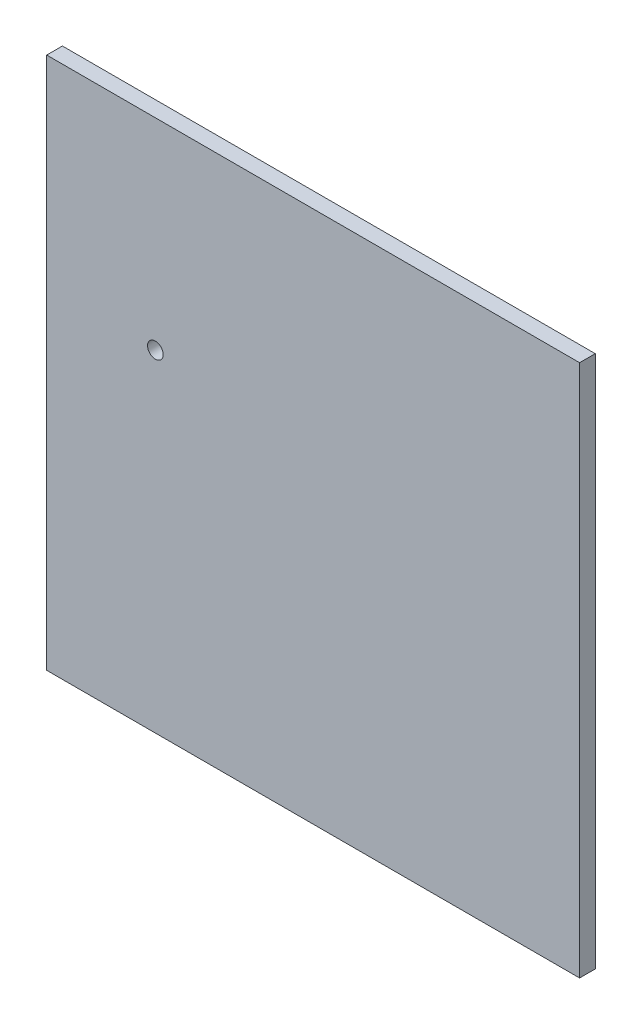
ISO-10303-21;
HEADER;
FILE_DESCRIPTION(('STEP AP214'),'2;1');
FILE_NAME('part.step','',(''),(''),'','','');
FILE_SCHEMA(('AUTOMOTIVE_DESIGN { 1 0 10303 214 1 1 1 1 }'));
ENDSEC;
DATA;
#1=APPLICATION_CONTEXT('core data for automotive mechanical design processes');
#2=APPLICATION_PROTOCOL_DEFINITION('international standard','automotive_design',2000,#1);
#3=PRODUCT_CONTEXT('',#1,'mechanical');
#4=PRODUCT('Part','Part','',(#3));
#5=PRODUCT_RELATED_PRODUCT_CATEGORY('part','',(#4));
#6=PRODUCT_DEFINITION_FORMATION('','',#4);
#7=PRODUCT_DEFINITION_CONTEXT('part definition',#1,'design');
#8=PRODUCT_DEFINITION('design','',#6,#7);
#9=PRODUCT_DEFINITION_SHAPE('','',#8);
#10=(LENGTH_UNIT() NAMED_UNIT(*) SI_UNIT(.MILLI.,.METRE.));
#11=(NAMED_UNIT(*) PLANE_ANGLE_UNIT() SI_UNIT($,.RADIAN.));
#12=(NAMED_UNIT(*) SI_UNIT($,.STERADIAN.) SOLID_ANGLE_UNIT());
#13=UNCERTAINTY_MEASURE_WITH_UNIT(LENGTH_MEASURE(1.E-05),#10,'distance_accuracy_value','');
#14=(GEOMETRIC_REPRESENTATION_CONTEXT(3) GLOBAL_UNCERTAINTY_ASSIGNED_CONTEXT((#13)) GLOBAL_UNIT_ASSIGNED_CONTEXT((#10,
#11,#12)) REPRESENTATION_CONTEXT('',''));
#15=CARTESIAN_POINT('',(0.,0.,0.));
#16=DIRECTION('',(0.,0.,1.));
#17=DIRECTION('',(1.,0.,0.));
#18=AXIS2_PLACEMENT_3D('',#15,#16,#17);
#19=CARTESIAN_POINT('',(17.,17.,1.));
#20=DIRECTION('',(0.,-1.,0.));
#21=DIRECTION('',(0.,0.,-1.));
#22=AXIS2_PLACEMENT_3D('',#19,#20,#21);
#23=PLANE('',#22);
#24=DIRECTION('',(-1.,0.,0.));
#25=VECTOR('',#24,1.);
#26=CARTESIAN_POINT('',(17.,17.,0.));
#27=LINE('',#26,#25);
#28=CARTESIAN_POINT('',(17.,17.,0.));
#29=VERTEX_POINT('',#28);
#30=CARTESIAN_POINT('',(-17.,17.,0.));
#31=VERTEX_POINT('',#30);
#32=EDGE_CURVE('E104',#29,#31,#27,.T.);
#33=ORIENTED_EDGE('',*,*,#32,.T.);
#34=DIRECTION('',(0.,0.,-1.));
#35=VECTOR('',#34,1.);
#36=CARTESIAN_POINT('',(-17.,17.,1.));
#37=LINE('',#36,#35);
#38=CARTESIAN_POINT('',(-17.,17.,1.));
#39=VERTEX_POINT('',#38);
#40=EDGE_CURVE('E11',#39,#31,#37,.T.);
#41=ORIENTED_EDGE('',*,*,#40,.F.);
#42=DIRECTION('',(-1.,0.,0.));
#43=VECTOR('',#42,1.);
#44=CARTESIAN_POINT('',(17.,17.,1.));
#45=LINE('',#44,#43);
#46=CARTESIAN_POINT('',(17.,17.,1.));
#47=VERTEX_POINT('',#46);
#48=EDGE_CURVE('E92',#47,#39,#45,.T.);
#49=ORIENTED_EDGE('',*,*,#48,.F.);
#50=DIRECTION('',(0.,0.,-1.));
#51=VECTOR('',#50,1.);
#52=CARTESIAN_POINT('',(17.,17.,1.));
#53=LINE('',#52,#51);
#54=EDGE_CURVE('E100',#47,#29,#53,.T.);
#55=ORIENTED_EDGE('',*,*,#54,.T.);
#56=EDGE_LOOP('',(#33,#41,#49,#55));
#57=FACE_BOUND('',#56,.T.);
#58=ADVANCED_FACE('F41',(#57),#23,.F.);
#59=CARTESIAN_POINT('',(-17.,-17.,1.));
#60=DIRECTION('',(1.,0.,0.));
#61=DIRECTION('',(0.,0.,-1.));
#62=AXIS2_PLACEMENT_3D('',#59,#60,#61);
#63=PLANE('',#62);
#64=DIRECTION('',(0.,-1.,0.));
#65=VECTOR('',#64,1.);
#66=CARTESIAN_POINT('',(-17.,-17.,0.));
#67=LINE('',#66,#65);
#68=CARTESIAN_POINT('',(-17.,-17.,0.));
#69=VERTEX_POINT('',#68);
#70=EDGE_CURVE('E96',#31,#69,#67,.T.);
#71=ORIENTED_EDGE('',*,*,#70,.T.);
#72=DIRECTION('',(0.,0.,-1.));
#73=VECTOR('',#72,1.);
#74=CARTESIAN_POINT('',(-17.,-17.,1.));
#75=LINE('',#74,#73);
#76=CARTESIAN_POINT('',(-17.,-17.,1.));
#77=VERTEX_POINT('',#76);
#78=EDGE_CURVE('E49',#77,#69,#75,.T.);
#79=ORIENTED_EDGE('',*,*,#78,.F.);
#80=DIRECTION('',(0.,-1.,0.));
#81=VECTOR('',#80,1.);
#82=CARTESIAN_POINT('',(-17.,-17.,1.));
#83=LINE('',#82,#81);
#84=EDGE_CURVE('E87',#39,#77,#83,.T.);
#85=ORIENTED_EDGE('',*,*,#84,.F.);
#86=ORIENTED_EDGE('',*,*,#40,.T.);
#87=EDGE_LOOP('',(#71,#79,#85,#86));
#88=FACE_BOUND('',#87,.T.);
#89=ADVANCED_FACE('F95',(#88),#63,.F.);
#90=CARTESIAN_POINT('',(17.,-17.,1.));
#91=DIRECTION('',(0.,1.,0.));
#92=DIRECTION('',(0.,0.,1.));
#93=AXIS2_PLACEMENT_3D('',#90,#91,#92);
#94=PLANE('',#93);
#95=DIRECTION('',(1.,0.,0.));
#96=VECTOR('',#95,1.);
#97=CARTESIAN_POINT('',(17.,-17.,0.));
#98=LINE('',#97,#96);
#99=CARTESIAN_POINT('',(17.,-17.,0.));
#100=VERTEX_POINT('',#99);
#101=EDGE_CURVE('E74',#69,#100,#98,.T.);
#102=ORIENTED_EDGE('',*,*,#101,.T.);
#103=DIRECTION('',(0.,0.,-1.));
#104=VECTOR('',#103,1.);
#105=CARTESIAN_POINT('',(17.,-17.,1.));
#106=LINE('',#105,#104);
#107=CARTESIAN_POINT('',(17.,-17.,1.));
#108=VERTEX_POINT('',#107);
#109=EDGE_CURVE('E97',#108,#100,#106,.T.);
#110=ORIENTED_EDGE('',*,*,#109,.F.);
#111=DIRECTION('',(1.,0.,0.));
#112=VECTOR('',#111,1.);
#113=CARTESIAN_POINT('',(17.,-17.,1.));
#114=LINE('',#113,#112);
#115=EDGE_CURVE('E90',#77,#108,#114,.T.);
#116=ORIENTED_EDGE('',*,*,#115,.F.);
#117=ORIENTED_EDGE('',*,*,#78,.T.);
#118=EDGE_LOOP('',(#102,#110,#116,#117));
#119=FACE_BOUND('',#118,.T.);
#120=ADVANCED_FACE('F98',(#119),#94,.F.);
#121=CARTESIAN_POINT('',(17.,-17.,1.));
#122=DIRECTION('',(-1.,0.,0.));
#123=DIRECTION('',(0.,0.,1.));
#124=AXIS2_PLACEMENT_3D('',#121,#122,#123);
#125=PLANE('',#124);
#126=DIRECTION('',(0.,1.,0.));
#127=VECTOR('',#126,1.);
#128=CARTESIAN_POINT('',(17.,-17.,0.));
#129=LINE('',#128,#127);
#130=EDGE_CURVE('E80',#100,#29,#129,.T.);
#131=ORIENTED_EDGE('',*,*,#130,.T.);
#132=ORIENTED_EDGE('',*,*,#54,.F.);
#133=DIRECTION('',(0.,1.,0.));
#134=VECTOR('',#133,1.);
#135=CARTESIAN_POINT('',(17.,-17.,1.));
#136=LINE('',#135,#134);
#137=EDGE_CURVE('E57',#108,#47,#136,.T.);
#138=ORIENTED_EDGE('',*,*,#137,.F.);
#139=ORIENTED_EDGE('',*,*,#109,.T.);
#140=EDGE_LOOP('',(#131,#132,#138,#139));
#141=FACE_BOUND('',#140,.T.);
#142=ADVANCED_FACE('F112',(#141),#125,.F.);
#143=CARTESIAN_POINT('',(0.,0.,1.));
#144=DIRECTION('',(0.,0.,-1.));
#145=DIRECTION('',(-1.,0.,0.));
#146=AXIS2_PLACEMENT_3D('',#143,#144,#145);
#147=PLANE('',#146);
#148=CARTESIAN_POINT('',(-10.0676540105553,4.16018437454113,1.));
#149=DIRECTION('',(0.,0.,1.));
#150=DIRECTION('',(1.,0.,0.));
#151=AXIS2_PLACEMENT_3D('',#148,#149,#150);
#152=CIRCLE('',#151,0.500000000000001);
#153=CARTESIAN_POINT('',(-9.56765401055532,4.16018437454113,1.));
#154=VERTEX_POINT('',#153);
#155=EDGE_CURVE('E118',#154,#154,#152,.T.);
#156=ORIENTED_EDGE('',*,*,#155,.F.);
#157=EDGE_LOOP('',(#156));
#158=FACE_BOUND('',#157,.T.);
#159=ORIENTED_EDGE('',*,*,#48,.T.);
#160=ORIENTED_EDGE('',*,*,#84,.T.);
#161=ORIENTED_EDGE('',*,*,#115,.T.);
#162=ORIENTED_EDGE('',*,*,#137,.T.);
#163=EDGE_LOOP('',(#159,#160,#161,#162));
#164=FACE_BOUND('',#163,.T.);
#165=ADVANCED_FACE('F88',(#158,#164),#147,.F.);
#166=CARTESIAN_POINT('',(0.,0.,0.));
#167=DIRECTION('',(0.,0.,-1.));
#168=DIRECTION('',(-1.,0.,0.));
#169=AXIS2_PLACEMENT_3D('',#166,#167,#168);
#170=PLANE('',#169);
#171=CARTESIAN_POINT('',(-10.0676540105553,4.16018437454113,0.));
#172=DIRECTION('',(0.,0.,1.));
#173=DIRECTION('',(1.,0.,0.));
#174=AXIS2_PLACEMENT_3D('',#171,#172,#173);
#175=CIRCLE('',#174,0.500000000000001);
#176=CARTESIAN_POINT('',(-9.56765401055532,4.16018437454113,0.));
#177=VERTEX_POINT('',#176);
#178=EDGE_CURVE('E107',#177,#177,#175,.T.);
#179=ORIENTED_EDGE('',*,*,#178,.T.);
#180=EDGE_LOOP('',(#179));
#181=FACE_BOUND('',#180,.T.);
#182=ORIENTED_EDGE('',*,*,#32,.F.);
#183=ORIENTED_EDGE('',*,*,#130,.F.);
#184=ORIENTED_EDGE('',*,*,#101,.F.);
#185=ORIENTED_EDGE('',*,*,#70,.F.);
#186=EDGE_LOOP('',(#182,#183,#184,#185));
#187=FACE_BOUND('',#186,.T.);
#188=ADVANCED_FACE('F115',(#181,#187),#170,.T.);
#189=CARTESIAN_POINT('',(-10.0676540105553,4.16018437454113,0.));
#190=DIRECTION('',(0.,0.,1.));
#191=DIRECTION('',(1.,0.,0.));
#192=AXIS2_PLACEMENT_3D('',#189,#190,#191);
#193=CYLINDRICAL_SURFACE('',#192,0.500000000000001);
#194=ORIENTED_EDGE('',*,*,#178,.F.);
#195=EDGE_LOOP('',(#194));
#196=FACE_BOUND('',#195,.T.);
#197=ORIENTED_EDGE('',*,*,#155,.T.);
#198=EDGE_LOOP('',(#197));
#199=FACE_BOUND('',#198,.T.);
#200=ADVANCED_FACE('F125',(#196,#199),#193,.F.);
#201=CLOSED_SHELL('',(#58,#89,#120,#142,#165,#188,#200));
#202=MANIFOLD_SOLID_BREP('B2',#201);
#203=ADVANCED_BREP_SHAPE_REPRESENTATION('',(#18,#202),#14);
#204=SHAPE_DEFINITION_REPRESENTATION(#9,#203);
ENDSEC;
END-ISO-10303-21;
